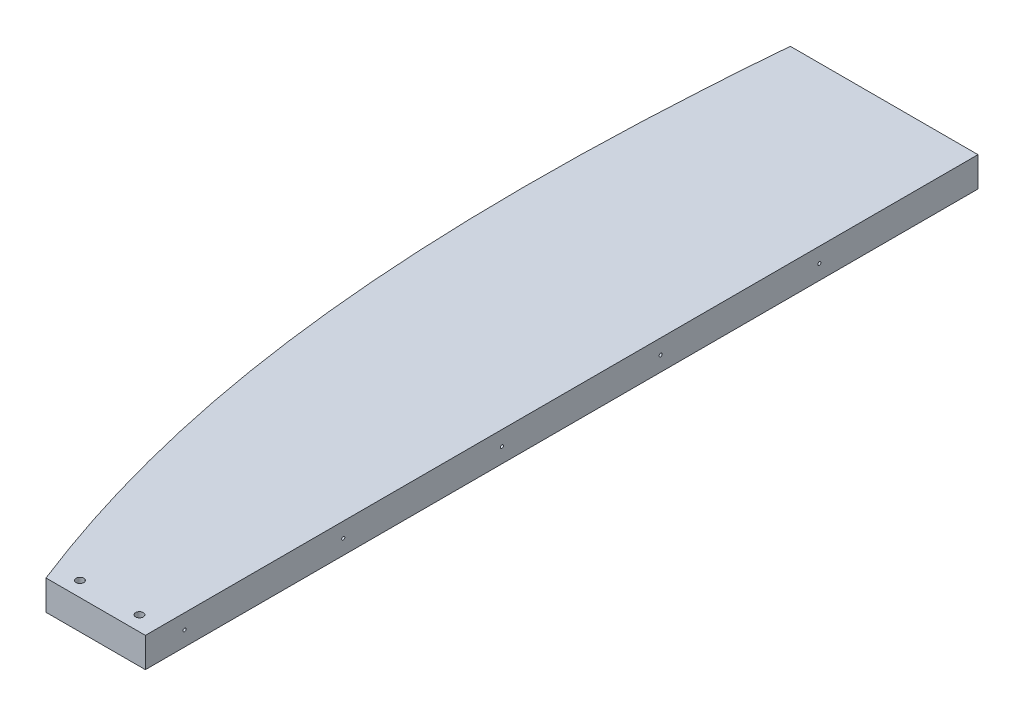
ISO-10303-21;
HEADER;
FILE_DESCRIPTION(('STEP AP214'),'2;1');
FILE_NAME('part.step','',(''),(''),'','','');
FILE_SCHEMA(('AUTOMOTIVE_DESIGN { 1 0 10303 214 1 1 1 1 }'));
ENDSEC;
DATA;
#1=APPLICATION_CONTEXT('core data for automotive mechanical design processes');
#2=APPLICATION_PROTOCOL_DEFINITION('international standard','automotive_design',2000,#1);
#3=PRODUCT_CONTEXT('',#1,'mechanical');
#4=PRODUCT('Part','Part','',(#3));
#5=PRODUCT_RELATED_PRODUCT_CATEGORY('part','',(#4));
#6=PRODUCT_DEFINITION_FORMATION('','',#4);
#7=PRODUCT_DEFINITION_CONTEXT('part definition',#1,'design');
#8=PRODUCT_DEFINITION('design','',#6,#7);
#9=PRODUCT_DEFINITION_SHAPE('','',#8);
#10=(LENGTH_UNIT() NAMED_UNIT(*) SI_UNIT(.MILLI.,.METRE.));
#11=(NAMED_UNIT(*) PLANE_ANGLE_UNIT() SI_UNIT($,.RADIAN.));
#12=(NAMED_UNIT(*) SI_UNIT($,.STERADIAN.) SOLID_ANGLE_UNIT());
#13=UNCERTAINTY_MEASURE_WITH_UNIT(LENGTH_MEASURE(1.E-05),#10,'distance_accuracy_value','');
#14=(GEOMETRIC_REPRESENTATION_CONTEXT(3) GLOBAL_UNCERTAINTY_ASSIGNED_CONTEXT((#13)) GLOBAL_UNIT_ASSIGNED_CONTEXT((#10,
#11,#12)) REPRESENTATION_CONTEXT('',''));
#15=CARTESIAN_POINT('',(0.,0.,0.));
#16=DIRECTION('',(0.,0.,1.));
#17=DIRECTION('',(1.,0.,0.));
#18=AXIS2_PLACEMENT_3D('',#15,#16,#17);
#19=CARTESIAN_POINT('',(-389.501606786899,5194.30000000001,2950.05622050594));
#20=DIRECTION('',(0.,1.,0.));
#21=DIRECTION('',(1.,0.,0.));
#22=AXIS2_PLACEMENT_3D('',#19,#20,#21);
#23=PLANE('',#22);
#24=CARTESIAN_POINT('',(-376.528681754764,5194.3,3207.07744091049));
#25=DIRECTION('',(0.,-1.,0.));
#26=DIRECTION('',(1.,0.,0.));
#27=AXIS2_PLACEMENT_3D('',#24,#25,#26);
#28=CIRCLE('',#27,2.45744999999997);
#29=CARTESIAN_POINT('',(-374.071231754764,5194.3,3207.07744091049));
#30=VERTEX_POINT('',#29);
#31=EDGE_CURVE('E239',#30,#30,#28,.T.);
#32=ORIENTED_EDGE('',*,*,#31,.F.);
#33=EDGE_LOOP('',(#32));
#34=FACE_BOUND('',#33,.T.);
#35=CARTESIAN_POINT('',(-338.428578956982,5194.3,3207.07744091058));
#36=DIRECTION('',(0.,-1.,0.));
#37=DIRECTION('',(1.,0.,0.));
#38=AXIS2_PLACEMENT_3D('',#35,#36,#37);
#39=CIRCLE('',#38,2.45744999999997);
#40=CARTESIAN_POINT('',(-335.971128956982,5194.3,3207.07744091058));
#41=VERTEX_POINT('',#40);
#42=EDGE_CURVE('E134',#41,#41,#39,.T.);
#43=ORIENTED_EDGE('',*,*,#42,.F.);
#44=EDGE_LOOP('',(#43));
#45=FACE_BOUND('',#44,.T.);
#46=DIRECTION('',(1.,0.,0.));
#47=VECTOR('',#46,1.);
#48=CARTESIAN_POINT('',(-445.271141729743,5194.3,2683.51));
#49=LINE('',#48,#47);
#50=CARTESIAN_POINT('',(-445.271141729743,5194.3,2683.51));
#51=VERTEX_POINT('',#50);
#52=CARTESIAN_POINT('',(-325.12,5194.30000000001,2683.51));
#53=VERTEX_POINT('',#52);
#54=EDGE_CURVE('E176',#51,#53,#49,.T.);
#55=ORIENTED_EDGE('',*,*,#54,.T.);
#56=DIRECTION('',(0.,0.,1.));
#57=VECTOR('',#56,1.);
#58=CARTESIAN_POINT('',(-325.12,5194.30000000001,2683.51));
#59=LINE('',#58,#57);
#60=CARTESIAN_POINT('',(-325.12,5194.30000000001,3216.60244101189));
#61=VERTEX_POINT('',#60);
#62=EDGE_CURVE('E192',#53,#61,#59,.T.);
#63=ORIENTED_EDGE('',*,*,#62,.T.);
#64=DIRECTION('',(-1.,0.,0.));
#65=VECTOR('',#64,1.);
#66=CARTESIAN_POINT('',(-325.12,5194.30000000001,3216.60244101189));
#67=LINE('',#66,#65);
#68=CARTESIAN_POINT('',(-388.748833209511,5194.3,3216.60244101189));
#69=VERTEX_POINT('',#68);
#70=EDGE_CURVE('E185',#61,#69,#67,.T.);
#71=ORIENTED_EDGE('',*,*,#70,.T.);
#72=CARTESIAN_POINT('',(-388.74883320951,5194.3,3216.60244101189));
#73=CARTESIAN_POINT('',(-389.522252968133,5194.30000000001,3214.63182176014));
#74=CARTESIAN_POINT('',(-390.288721724349,5194.30000000001,3212.65847358438));
#75=CARTESIAN_POINT('',(-391.807587176831,5194.30000000001,3208.70646110342));
#76=CARTESIAN_POINT('',(-392.559984442723,5194.30000000001,3206.72779701715));
#77=CARTESIAN_POINT('',(-394.050584006537,5194.30000000001,3202.7651760804));
#78=CARTESIAN_POINT('',(-394.788786601796,5194.30000000001,3200.78121934178));
#79=CARTESIAN_POINT('',(-396.25118247867,5194.30000000001,3196.8072370958));
#80=CARTESIAN_POINT('',(-396.975369962834,5194.30000000001,3194.81720945522));
#81=CARTESIAN_POINT('',(-398.409326379544,5194.30000000001,3190.8319153354));
#82=CARTESIAN_POINT('',(-399.11909500355,5194.30000000001,3188.83664874508));
#83=CARTESIAN_POINT('',(-400.524120705956,5194.30000000001,3184.84092335103));
#84=CARTESIAN_POINT('',(-401.219377144052,5194.3,3182.84046432257));
#85=CARTESIAN_POINT('',(-403.979981150922,5194.3,3174.80275179745));
#86=CARTESIAN_POINT('',(-405.98622936171,5194.30000000001,3168.7450562538));
#87=CARTESIAN_POINT('',(-409.864016063091,5194.30000000001,3156.58584521959));
#88=CARTESIAN_POINT('',(-411.735535675614,5194.30000000001,3150.48432371939));
#89=CARTESIAN_POINT('',(-415.342670234216,5194.30000000001,3138.24071743662));
#90=CARTESIAN_POINT('',(-417.078274865978,5194.30000000001,3132.09862961383));
#91=CARTESIAN_POINT('',(-420.413307310401,5194.30000000001,3119.77755039309));
#92=CARTESIAN_POINT('',(-422.01273391751,5194.30000000001,3113.59855866895));
#93=CARTESIAN_POINT('',(-425.076507654871,5194.30000000001,3101.20582036093));
#94=CARTESIAN_POINT('',(-426.540826480792,5194.30000000001,3094.99206678251));
#95=CARTESIAN_POINT('',(-429.335602965528,5194.30000000001,3082.53477442042));
#96=CARTESIAN_POINT('',(-430.666065285989,5194.30000000001,3076.29123668194));
#97=CARTESIAN_POINT('',(-433.195551254198,5194.30000000001,3063.77787947901));
#98=CARTESIAN_POINT('',(-434.394580050255,5194.30000000001,3057.50806105398));
#99=CARTESIAN_POINT('',(-436.664262798693,5194.30000000001,3044.94572418597));
#100=CARTESIAN_POINT('',(-437.734926596353,5194.3,3038.65320752207));
#101=CARTESIAN_POINT('',(-439.412841289309,5194.3,3028.16585891989));
#102=CARTESIAN_POINT('',(-440.054930598951,5194.30000000001,3023.97656044392));
#103=CARTESIAN_POINT('',(-441.285326649012,5194.30000000001,3015.59028760335));
#104=CARTESIAN_POINT('',(-441.87363620708,5194.30000000001,3011.39331365267));
#105=CARTESIAN_POINT('',(-442.997751229943,5194.30000000001,3002.99243079538));
#106=CARTESIAN_POINT('',(-443.533557687155,5194.30000000001,2998.7885220214));
#107=CARTESIAN_POINT('',(-444.553830346814,5194.30000000001,2990.37588429152));
#108=CARTESIAN_POINT('',(-445.038313336257,5194.30000000001,2986.16715736967));
#109=CARTESIAN_POINT('',(-445.95751189761,5194.30000000001,2977.74420167879));
#110=CARTESIAN_POINT('',(-446.392226612659,5194.30000000001,2973.5299728163));
#111=CARTESIAN_POINT('',(-447.213286250905,5194.30000000001,2965.0967391719));
#112=CARTESIAN_POINT('',(-447.59963020829,5194.3,2960.87773429634));
#113=CARTESIAN_POINT('',(-448.610399554394,5194.3,2949.12002029531));
#114=CARTESIAN_POINT('',(-449.183460079722,5194.30000000001,2941.57684955929));
#115=CARTESIAN_POINT('',(-450.188110587307,5194.30000000001,2926.48082596249));
#116=CARTESIAN_POINT('',(-450.61969436184,5194.30000000001,2918.92797269146));
#117=CARTESIAN_POINT('',(-451.167099565232,5194.30000000001,2907.5939338846));
#118=CARTESIAN_POINT('',(-451.332907313244,5194.30000000001,2903.81509221511));
#119=CARTESIAN_POINT('',(-451.632200630418,5194.30000000001,2896.2561191346));
#120=CARTESIAN_POINT('',(-451.765686187027,5194.30000000001,2892.47598772308));
#121=CARTESIAN_POINT('',(-452.001447257514,5194.30000000001,2884.91259385326));
#122=CARTESIAN_POINT('',(-452.10370488907,5194.30000000001,2881.12933084029));
#123=CARTESIAN_POINT('',(-452.277368935584,5194.30000000001,2873.56209999784));
#124=CARTESIAN_POINT('',(-452.348775360838,5194.30000000001,2869.77813216859));
#125=CARTESIAN_POINT('',(-452.462007398325,5194.30000000001,2862.20982426264));
#126=CARTESIAN_POINT('',(-452.503833548245,5194.30000000001,2858.42548419396));
#127=CARTESIAN_POINT('',(-452.558952189984,5194.30000000001,2850.85660436911));
#128=CARTESIAN_POINT('',(-452.572244665882,5194.30000000001,2847.07206461283));
#129=CARTESIAN_POINT('',(-452.570825815496,5194.30000000001,2835.71848246225));
#130=CARTESIAN_POINT('',(-452.514819254079,5194.3,2828.14940488104));
#131=CARTESIAN_POINT('',(-452.325706518356,5194.3,2814.8576360439));
#132=CARTESIAN_POINT('',(-452.214721414389,5194.30000000001,2809.13460593405));
#133=CARTESIAN_POINT('',(-451.936070151196,5194.30000000001,2797.68993762865));
#134=CARTESIAN_POINT('',(-451.768404183396,5194.30000000001,2791.96829942846));
#135=CARTESIAN_POINT('',(-451.378470854025,5194.30000000001,2780.52685123598));
#136=CARTESIAN_POINT('',(-451.156203086374,5194.30000000001,2774.80704125759));
#137=CARTESIAN_POINT('',(-450.658785505361,5194.30000000001,2763.36967450208));
#138=CARTESIAN_POINT('',(-450.3836352264,5194.30000000001,2757.65211774522));
#139=CARTESIAN_POINT('',(-449.782227506014,5194.30000000001,2746.22711571753));
#140=CARTESIAN_POINT('',(-449.456036663211,5194.30000000001,2740.51966693659));
#141=CARTESIAN_POINT('',(-448.75333687339,5194.30000000001,2729.10791697049));
#142=CARTESIAN_POINT('',(-448.376828318642,5194.30000000001,2723.40361576115));
#143=CARTESIAN_POINT('',(-447.574201897389,5194.30000000001,2711.99864715379));
#144=CARTESIAN_POINT('',(-447.148085321015,5194.30000000001,2706.29797966515));
#145=CARTESIAN_POINT('',(-446.471952170237,5194.30000000001,2697.75005038914));
#146=CARTESIAN_POINT('',(-446.240420243813,5194.30000000001,2694.9013153148));
#147=CARTESIAN_POINT('',(-445.765028486666,5194.30000000001,2689.20487423171));
#148=CARTESIAN_POINT('',(-445.521168656988,5194.30000000001,2686.35716822288));
#149=CARTESIAN_POINT('',(-445.271141729742,5194.3,2683.51));
#150=B_SPLINE_CURVE_WITH_KNOTS('',3,(#72,#73,#74,#75,#76,#77,#78,#79,#80,#81,#82,#83,#84,#85,
#86,#87,#88,#89,#90,#91,#92,#93,#94,#95,#96,#97,#98,#99,#100,#101,#102,#103,#104,#105,#106,#107,
#108,#109,#110,#111,#112,#113,#114,#115,#116,#117,#118,#119,#120,#121,#122,#123,#124,#125,#126,
#127,#128,#129,#130,#131,#132,#133,#134,#135,#136,#137,#138,#139,#140,#141,#142,#143,#144,#145,
#146,#147,#148,#149),.UNSPECIFIED.,.F.,.F.,(4,2,2,2,2,2,2,2,2,2,2,2,2,2,2,2,2,2,2,2,2,2,2,2,2,2,
2,2,2,2,2,2,2,2,2,2,2,2,4),(0.,6.35086701356958,12.7014763794555,19.051952573682,
25.4050018387976,31.7581869055687,38.1116516963094,57.2537350240519,76.3984953265147,
95.5447070815515,114.691088315576,133.841471545987,152.991187620061,172.140153323164,
191.287649407017,204.001986076296,216.715656228674,229.42908601974,242.13834455025,
254.847821863678,267.55755290496,290.250765480575,312.944973656978,324.292291318835,
335.639613387368,346.993421240414,358.347225304224,369.700822982525,381.054426996128,
403.761418106075,420.933479573431,438.105483047311,455.277614235264,472.449896620545,
489.599956338763,506.749882365399,523.899362482218,532.473724957064,541.048086704671),.UNSPECIFIED.);
#151=EDGE_CURVE('E183',#69,#51,#150,.T.);
#152=ORIENTED_EDGE('',*,*,#151,.T.);
#153=EDGE_LOOP('',(#55,#63,#71,#152));
#154=FACE_BOUND('',#153,.T.);
#155=ADVANCED_FACE('F50',(#34,#45,#154),#23,.F.);
#156=CARTESIAN_POINT('',(-325.12,5194.30000000001,2683.51));
#157=DIRECTION('',(1.,0.,0.));
#158=DIRECTION('',(0.,-1.,0.));
#159=AXIS2_PLACEMENT_3D('',#156,#157,#158);
#160=PLANE('',#159);
#161=CARTESIAN_POINT('',(-325.119999999999,5203.82500000001,2785.11));
#162=DIRECTION('',(-1.,0.,0.));
#163=DIRECTION('',(0.,-1.,0.));
#164=AXIS2_PLACEMENT_3D('',#161,#162,#163);
#165=CIRCLE('',#164,0.991870000000006);
#166=CARTESIAN_POINT('',(-325.119999999999,5202.83313000001,2785.11));
#167=VERTEX_POINT('',#166);
#168=EDGE_CURVE('E57',#167,#167,#165,.T.);
#169=ORIENTED_EDGE('',*,*,#168,.T.);
#170=EDGE_LOOP('',(#169));
#171=FACE_BOUND('',#170,.T.);
#172=CARTESIAN_POINT('',(-325.119999999999,5203.825,2886.71));
#173=DIRECTION('',(-1.,0.,0.));
#174=DIRECTION('',(0.,-1.,0.));
#175=AXIS2_PLACEMENT_3D('',#172,#173,#174);
#176=CIRCLE('',#175,0.991870000000006);
#177=CARTESIAN_POINT('',(-325.119999999999,5202.83313,2886.71));
#178=VERTEX_POINT('',#177);
#179=EDGE_CURVE('E145',#178,#178,#176,.T.);
#180=ORIENTED_EDGE('',*,*,#179,.T.);
#181=EDGE_LOOP('',(#180));
#182=FACE_BOUND('',#181,.T.);
#183=CARTESIAN_POINT('',(-325.119999999999,5203.825,2988.31));
#184=DIRECTION('',(-1.,0.,0.));
#185=DIRECTION('',(0.,-1.,0.));
#186=AXIS2_PLACEMENT_3D('',#183,#184,#185);
#187=CIRCLE('',#186,0.991870000000006);
#188=CARTESIAN_POINT('',(-325.119999999999,5202.83313,2988.31));
#189=VERTEX_POINT('',#188);
#190=EDGE_CURVE('E149',#189,#189,#187,.T.);
#191=ORIENTED_EDGE('',*,*,#190,.T.);
#192=EDGE_LOOP('',(#191));
#193=FACE_BOUND('',#192,.T.);
#194=CARTESIAN_POINT('',(-325.119999999999,5203.82500000001,3089.91));
#195=DIRECTION('',(-1.,0.,0.));
#196=DIRECTION('',(0.,-1.,0.));
#197=AXIS2_PLACEMENT_3D('',#194,#195,#196);
#198=CIRCLE('',#197,0.991870000000006);
#199=CARTESIAN_POINT('',(-325.119999999999,5202.83313000001,3089.91));
#200=VERTEX_POINT('',#199);
#201=EDGE_CURVE('E153',#200,#200,#198,.T.);
#202=ORIENTED_EDGE('',*,*,#201,.T.);
#203=EDGE_LOOP('',(#202));
#204=FACE_BOUND('',#203,.T.);
#205=CARTESIAN_POINT('',(-325.119999999999,5203.825,3191.51));
#206=DIRECTION('',(-1.,0.,0.));
#207=DIRECTION('',(0.,-1.,0.));
#208=AXIS2_PLACEMENT_3D('',#205,#206,#207);
#209=CIRCLE('',#208,0.991870000000006);
#210=CARTESIAN_POINT('',(-325.119999999999,5202.83313,3191.51));
#211=VERTEX_POINT('',#210);
#212=EDGE_CURVE('E157',#211,#211,#209,.T.);
#213=ORIENTED_EDGE('',*,*,#212,.T.);
#214=EDGE_LOOP('',(#213));
#215=FACE_BOUND('',#214,.T.);
#216=DIRECTION('',(0.,0.,1.));
#217=VECTOR('',#216,1.);
#218=CARTESIAN_POINT('',(-325.12,5213.35,2950.05622050594));
#219=LINE('',#218,#217);
#220=CARTESIAN_POINT('',(-325.119999999999,5213.35,2683.51));
#221=VERTEX_POINT('',#220);
#222=CARTESIAN_POINT('',(-325.119999999999,5213.35,3216.60244101189));
#223=VERTEX_POINT('',#222);
#224=EDGE_CURVE('E170',#221,#223,#219,.T.);
#225=ORIENTED_EDGE('',*,*,#224,.T.);
#226=DIRECTION('',(0.,1.,0.));
#227=VECTOR('',#226,1.);
#228=CARTESIAN_POINT('',(-325.12,5194.30000000001,3216.60244101189));
#229=LINE('',#228,#227);
#230=EDGE_CURVE('E93',#223,#61,#229,.F.);
#231=ORIENTED_EDGE('',*,*,#230,.T.);
#232=ORIENTED_EDGE('',*,*,#62,.F.);
#233=DIRECTION('',(0.,1.,0.));
#234=VECTOR('',#233,1.);
#235=CARTESIAN_POINT('',(-325.12,5194.30000000001,2683.51));
#236=LINE('',#235,#234);
#237=EDGE_CURVE('E104',#53,#221,#236,.T.);
#238=ORIENTED_EDGE('',*,*,#237,.T.);
#239=EDGE_LOOP('',(#225,#231,#232,#238));
#240=FACE_BOUND('',#239,.T.);
#241=ADVANCED_FACE('F228',(#171,#182,#193,#204,#215,#240),#160,.T.);
#242=CARTESIAN_POINT('',(-325.12,5194.30000000001,3216.60244101189));
#243=DIRECTION('',(0.,0.,1.));
#244=DIRECTION('',(-1.,0.,0.));
#245=AXIS2_PLACEMENT_3D('',#242,#243,#244);
#246=PLANE('',#245);
#247=DIRECTION('',(1.,0.,0.));
#248=VECTOR('',#247,1.);
#249=CARTESIAN_POINT('',(-389.5016067869,5213.35000000001,3216.60244101189));
#250=LINE('',#249,#248);
#251=CARTESIAN_POINT('',(-388.748833209508,5213.35000000001,3216.60244101189));
#252=VERTEX_POINT('',#251);
#253=EDGE_CURVE('E168',#223,#252,#250,.F.);
#254=ORIENTED_EDGE('',*,*,#253,.T.);
#255=DIRECTION('',(-1.36946010087513E-13,-1.,0.));
#256=VECTOR('',#255,1.);
#257=CARTESIAN_POINT('',(-388.74883320951,5203.82500000001,3216.60244101189));
#258=LINE('',#257,#256);
#259=EDGE_CURVE('E82',#252,#69,#258,.T.);
#260=ORIENTED_EDGE('',*,*,#259,.T.);
#261=ORIENTED_EDGE('',*,*,#70,.F.);
#262=ORIENTED_EDGE('',*,*,#230,.F.);
#263=EDGE_LOOP('',(#254,#260,#261,#262));
#264=FACE_BOUND('',#263,.T.);
#265=ADVANCED_FACE('F225',(#264),#246,.T.);
#266=CARTESIAN_POINT('',(-388.74883320951,5194.3,3216.60244101189));
#267=CARTESIAN_POINT('',(-388.748833209508,5213.35000000001,3216.60244101189));
#268=CARTESIAN_POINT('',(-427.328274562889,5194.30000000001,3118.30445867765));
#269=CARTESIAN_POINT('',(-427.328274562889,5213.35000000001,3118.30445867765));
#270=CARTESIAN_POINT('',(-448.538626648828,5194.3,3013.430965814));
#271=CARTESIAN_POINT('',(-448.538626648824,5213.35000000001,3013.430965814));
#272=CARTESIAN_POINT('',(-453.875260666028,5194.30000000001,2815.15896694759));
#273=CARTESIAN_POINT('',(-453.875260666026,5213.35000000001,2815.15896694759));
#274=CARTESIAN_POINT('',(-450.721614948779,5194.3,2745.57602142326));
#275=CARTESIAN_POINT('',(-450.721614948777,5213.35,2745.57602142326));
#276=CARTESIAN_POINT('',(-445.271141729743,5194.3,2683.51));
#277=CARTESIAN_POINT('',(-445.271141729743,5213.35,2683.51));
#278=B_SPLINE_SURFACE_WITH_KNOTS('',3,1,((#266,#267),(#268,#269),(#270,#271),(#272,#273),(#274,
#275),(#276,#277)),.UNSPECIFIED.,.F.,.F.,.F.,(4,2,4),(2,2),(-53.1349686655124,-24.0856941468216,
-9.03456928373366),(0.,1.90499999999997),.UNSPECIFIED.);
#279=CARTESIAN_POINT('',(-388.748833209508,5213.35000000001,3216.60244101189));
#280=CARTESIAN_POINT('',(-389.522252968131,5213.35000000001,3214.63182176014));
#281=CARTESIAN_POINT('',(-390.288721724347,5213.35000000001,3212.65847358438));
#282=CARTESIAN_POINT('',(-391.807587176829,5213.35000000001,3208.70646110342));
#283=CARTESIAN_POINT('',(-392.559984442721,5213.35000000001,3206.72779701715));
#284=CARTESIAN_POINT('',(-394.050584006536,5213.35000000001,3202.7651760804));
#285=CARTESIAN_POINT('',(-394.788786601795,5213.35000000001,3200.78121934178));
#286=CARTESIAN_POINT('',(-396.251182478668,5213.35000000001,3196.80723709581));
#287=CARTESIAN_POINT('',(-396.975369962833,5213.35000000001,3194.81720945522));
#288=CARTESIAN_POINT('',(-398.409326379543,5213.35000000001,3190.8319153354));
#289=CARTESIAN_POINT('',(-399.119095003549,5213.35000000001,3188.83664874508));
#290=CARTESIAN_POINT('',(-400.524120705955,5213.35000000001,3184.84092335103));
#291=CARTESIAN_POINT('',(-401.219377144051,5213.35,3182.84046432257));
#292=CARTESIAN_POINT('',(-403.979981150921,5213.35,3174.80275179745));
#293=CARTESIAN_POINT('',(-405.986229361709,5213.35000000001,3168.7450562538));
#294=CARTESIAN_POINT('',(-409.86401606309,5213.35000000001,3156.58584521959));
#295=CARTESIAN_POINT('',(-411.735535675613,5213.35000000001,3150.48432371939));
#296=CARTESIAN_POINT('',(-415.342670234215,5213.35000000001,3138.24071743662));
#297=CARTESIAN_POINT('',(-417.078274865977,5213.35000000001,3132.09862961383));
#298=CARTESIAN_POINT('',(-420.413307310399,5213.35000000001,3119.77755039309));
#299=CARTESIAN_POINT('',(-422.012733917509,5213.35000000001,3113.59855866895));
#300=CARTESIAN_POINT('',(-425.07650765487,5213.35000000001,3101.20582036093));
#301=CARTESIAN_POINT('',(-426.540826480791,5213.35000000001,3094.99206678251));
#302=CARTESIAN_POINT('',(-429.335602965527,5213.35000000001,3082.53477442042));
#303=CARTESIAN_POINT('',(-430.666065285987,5213.35000000001,3076.29123668194));
#304=CARTESIAN_POINT('',(-433.195551254196,5213.35000000001,3063.77787947901));
#305=CARTESIAN_POINT('',(-434.394580050253,5213.35000000001,3057.50806105398));
#306=CARTESIAN_POINT('',(-436.664262798691,5213.35000000001,3044.94572418597));
#307=CARTESIAN_POINT('',(-437.734926596351,5213.35,3038.65320752207));
#308=CARTESIAN_POINT('',(-439.412841289307,5213.35,3028.16585891989));
#309=CARTESIAN_POINT('',(-440.054930598949,5213.35000000001,3023.97656044392));
#310=CARTESIAN_POINT('',(-441.285326649009,5213.35000000001,3015.59028760335));
#311=CARTESIAN_POINT('',(-441.873636207078,5213.35000000001,3011.39331365267));
#312=CARTESIAN_POINT('',(-442.99775122994,5213.35000000001,3002.99243079538));
#313=CARTESIAN_POINT('',(-443.533557687153,5213.35000000001,2998.7885220214));
#314=CARTESIAN_POINT('',(-444.553830346812,5213.35000000001,2990.37588429152));
#315=CARTESIAN_POINT('',(-445.038313336254,5213.35000000001,2986.16715736967));
#316=CARTESIAN_POINT('',(-445.957511897607,5213.35000000001,2977.74420167879));
#317=CARTESIAN_POINT('',(-446.392226612657,5213.35000000001,2973.5299728163));
#318=CARTESIAN_POINT('',(-447.213286250903,5213.35000000001,2965.0967391719));
#319=CARTESIAN_POINT('',(-447.599630208288,5213.35,2960.87773429634));
#320=CARTESIAN_POINT('',(-448.610399554391,5213.35,2949.12002029531));
#321=CARTESIAN_POINT('',(-449.183460079719,5213.35000000001,2941.57684955929));
#322=CARTESIAN_POINT('',(-450.188110587304,5213.35000000001,2926.48082596249));
#323=CARTESIAN_POINT('',(-450.619694361837,5213.35000000001,2918.92797269146));
#324=CARTESIAN_POINT('',(-451.167099565229,5213.35000000001,2907.5939338846));
#325=CARTESIAN_POINT('',(-451.332907313241,5213.35000000001,2903.81509221511));
#326=CARTESIAN_POINT('',(-451.632200630415,5213.35000000001,2896.2561191346));
#327=CARTESIAN_POINT('',(-451.765686187025,5213.35000000001,2892.47598772308));
#328=CARTESIAN_POINT('',(-452.001447257511,5213.35000000001,2884.91259385326));
#329=CARTESIAN_POINT('',(-452.103704889068,5213.35000000001,2881.12933084029));
#330=CARTESIAN_POINT('',(-452.277368935581,5213.35000000001,2873.56209999784));
#331=CARTESIAN_POINT('',(-452.348775360835,5213.35000000001,2869.77813216859));
#332=CARTESIAN_POINT('',(-452.462007398322,5213.35000000001,2862.20982426264));
#333=CARTESIAN_POINT('',(-452.503833548242,5213.35000000001,2858.42548419396));
#334=CARTESIAN_POINT('',(-452.558952189981,5213.35000000001,2850.8566043691));
#335=CARTESIAN_POINT('',(-452.572244665879,5213.35000000001,2847.07206461283));
#336=CARTESIAN_POINT('',(-452.570825815494,5213.35000000001,2835.71848246225));
#337=CARTESIAN_POINT('',(-452.514819254077,5213.35,2828.14940488104));
#338=CARTESIAN_POINT('',(-452.325706518354,5213.35,2814.8576360439));
#339=CARTESIAN_POINT('',(-452.214721414387,5213.35000000001,2809.13460593405));
#340=CARTESIAN_POINT('',(-451.936070151194,5213.35000000001,2797.68993762865));
#341=CARTESIAN_POINT('',(-451.768404183394,5213.35000000001,2791.96829942846));
#342=CARTESIAN_POINT('',(-451.378470854023,5213.35000000001,2780.52685123598));
#343=CARTESIAN_POINT('',(-451.156203086372,5213.35000000001,2774.80704125759));
#344=CARTESIAN_POINT('',(-450.65878550536,5213.35000000001,2763.36967450208));
#345=CARTESIAN_POINT('',(-450.383635226399,5213.35000000001,2757.65211774522));
#346=CARTESIAN_POINT('',(-449.782227506013,5213.35000000001,2746.22711571754));
#347=CARTESIAN_POINT('',(-449.456036663209,5213.35000000001,2740.51966693659));
#348=CARTESIAN_POINT('',(-448.753336873388,5213.35000000001,2729.10791697049));
#349=CARTESIAN_POINT('',(-448.37682831864,5213.35000000001,2723.40361576115));
#350=CARTESIAN_POINT('',(-447.574201897388,5213.35000000001,2711.99864715379));
#351=CARTESIAN_POINT('',(-447.148085321015,5213.35000000001,2706.29797966515));
#352=CARTESIAN_POINT('',(-446.471952170236,5213.35000000001,2697.75005038914));
#353=CARTESIAN_POINT('',(-446.240420243812,5213.35000000001,2694.9013153148));
#354=CARTESIAN_POINT('',(-445.765028486665,5213.35000000001,2689.20487423171));
#355=CARTESIAN_POINT('',(-445.521168656988,5213.35000000001,2686.35716822288));
#356=CARTESIAN_POINT('',(-445.271141729743,5213.35,2683.51));
#357=B_SPLINE_CURVE_WITH_KNOTS('',3,(#279,#280,#281,#282,#283,#284,#285,#286,#287,#288,#289,
#290,#291,#292,#293,#294,#295,#296,#297,#298,#299,#300,#301,#302,#303,#304,#305,#306,#307,#308,
#309,#310,#311,#312,#313,#314,#315,#316,#317,#318,#319,#320,#321,#322,#323,#324,#325,#326,#327,
#328,#329,#330,#331,#332,#333,#334,#335,#336,#337,#338,#339,#340,#341,#342,#343,#344,#345,#346,
#347,#348,#349,#350,#351,#352,#353,#354,#355,#356),.UNSPECIFIED.,.F.,.F.,(4,2,2,2,2,2,2,2,2,2,2,
2,2,2,2,2,2,2,2,2,2,2,2,2,2,2,2,2,2,2,2,2,2,2,2,2,2,2,4),(0.,6.35086701356911,12.7014763794547,
19.0519525736817,25.4050018387973,31.7581869055684,38.1116516963087,57.2537350240516,
76.3984953265145,95.5447070815512,114.691088315576,133.841471545987,152.99118762006,
172.140153323165,191.287649407017,204.001986076296,216.715656228675,229.42908601974,
242.13834455025,254.847821863678,267.55755290496,290.250765480575,312.944973656978,
324.292291318835,335.639613387368,346.993421240414,358.347225304224,369.700822982526,
381.054426996129,403.761418106075,420.933479573431,438.10548304731,455.277614235263,
472.449896620544,489.599956338762,506.749882365398,523.899362482217,532.473724957062,
541.04808670467),.UNSPECIFIED.);
#358=CARTESIAN_POINT('',(-445.271141729743,5213.35000000001,2683.51));
#359=VERTEX_POINT('',#358);
#360=EDGE_CURVE('E63',#252,#359,#357,.T.);
#361=DIRECTION('',(0.,1.,0.));
#362=VECTOR('',#361,1.);
#363=CARTESIAN_POINT('',(-445.271141729743,5194.3,2683.51));
#364=LINE('',#363,#362);
#365=EDGE_CURVE('E173',#359,#51,#364,.F.);
#366=ORIENTED_EDGE('',*,*,#360,.T.);
#367=ORIENTED_EDGE('',*,*,#365,.T.);
#368=ORIENTED_EDGE('',*,*,#151,.F.);
#369=ORIENTED_EDGE('',*,*,#259,.F.);
#370=EDGE_LOOP('',(#366,#367,#368,#369));
#371=FACE_BOUND('',#370,.T.);
#372=ADVANCED_FACE('F52',(#371),#278,.F.);
#373=CARTESIAN_POINT('',(-445.271141729743,5194.3,2683.51));
#374=DIRECTION('',(0.,0.,-1.));
#375=DIRECTION('',(1.,0.,0.));
#376=AXIS2_PLACEMENT_3D('',#373,#374,#375);
#377=PLANE('',#376);
#378=CARTESIAN_POINT('',(-414.990074060501,5203.825,2683.51));
#379=DIRECTION('',(0.,0.,1.));
#380=DIRECTION('',(1.,0.,0.));
#381=AXIS2_PLACEMENT_3D('',#378,#379,#380);
#382=CIRCLE('',#381,0.991870000000006);
#383=CARTESIAN_POINT('',(-413.998204060501,5203.825,2683.51));
#384=VERTEX_POINT('',#383);
#385=EDGE_CURVE('E161',#384,#384,#382,.T.);
#386=ORIENTED_EDGE('',*,*,#385,.T.);
#387=EDGE_LOOP('',(#386));
#388=FACE_BOUND('',#387,.T.);
#389=CARTESIAN_POINT('',(-355.076691353501,5203.825,2683.51));
#390=DIRECTION('',(0.,0.,1.));
#391=DIRECTION('',(1.,0.,0.));
#392=AXIS2_PLACEMENT_3D('',#389,#390,#391);
#393=CIRCLE('',#392,0.991870000000006);
#394=CARTESIAN_POINT('',(-354.084821353501,5203.825,2683.51));
#395=VERTEX_POINT('',#394);
#396=EDGE_CURVE('E164',#395,#395,#393,.T.);
#397=ORIENTED_EDGE('',*,*,#396,.T.);
#398=EDGE_LOOP('',(#397));
#399=FACE_BOUND('',#398,.T.);
#400=DIRECTION('',(1.,0.,0.));
#401=VECTOR('',#400,1.);
#402=CARTESIAN_POINT('',(-389.5016067869,5213.35,2683.51));
#403=LINE('',#402,#401);
#404=EDGE_CURVE('E13',#359,#221,#403,.T.);
#405=ORIENTED_EDGE('',*,*,#404,.T.);
#406=ORIENTED_EDGE('',*,*,#237,.F.);
#407=ORIENTED_EDGE('',*,*,#54,.F.);
#408=ORIENTED_EDGE('',*,*,#365,.F.);
#409=EDGE_LOOP('',(#405,#406,#407,#408));
#410=FACE_BOUND('',#409,.T.);
#411=ADVANCED_FACE('F219',(#388,#399,#410),#377,.T.);
#412=CARTESIAN_POINT('',(-389.5016067869,5213.35,2950.05622050594));
#413=DIRECTION('',(0.,1.,0.));
#414=DIRECTION('',(1.,0.,0.));
#415=AXIS2_PLACEMENT_3D('',#412,#413,#414);
#416=PLANE('',#415);
#417=CARTESIAN_POINT('',(-376.528681754765,5213.35,3207.07744091049));
#418=DIRECTION('',(0.,-1.,0.));
#419=DIRECTION('',(0.,0.,1.));
#420=AXIS2_PLACEMENT_3D('',#417,#418,#419);
#421=CIRCLE('',#420,2.45744999999997);
#422=CARTESIAN_POINT('',(-376.528681754765,5213.35,3209.53489091049));
#423=VERTEX_POINT('',#422);
#424=EDGE_CURVE('E433',#423,#423,#421,.T.);
#425=ORIENTED_EDGE('',*,*,#424,.T.);
#426=EDGE_LOOP('',(#425));
#427=FACE_BOUND('',#426,.T.);
#428=CARTESIAN_POINT('',(-338.428578956982,5213.35,3207.07744091058));
#429=DIRECTION('',(0.,-1.,0.));
#430=DIRECTION('',(0.,0.,1.));
#431=AXIS2_PLACEMENT_3D('',#428,#429,#430);
#432=CIRCLE('',#431,2.45744999999997);
#433=CARTESIAN_POINT('',(-338.428578956982,5213.35,3209.53489091058));
#434=VERTEX_POINT('',#433);
#435=EDGE_CURVE('E139',#434,#434,#432,.T.);
#436=ORIENTED_EDGE('',*,*,#435,.T.);
#437=EDGE_LOOP('',(#436));
#438=FACE_BOUND('',#437,.T.);
#439=ORIENTED_EDGE('',*,*,#360,.F.);
#440=ORIENTED_EDGE('',*,*,#253,.F.);
#441=ORIENTED_EDGE('',*,*,#224,.F.);
#442=ORIENTED_EDGE('',*,*,#404,.F.);
#443=EDGE_LOOP('',(#439,#440,#441,#442));
#444=FACE_BOUND('',#443,.T.);
#445=ADVANCED_FACE('F213',(#427,#438,#444),#416,.T.);
#446=CARTESIAN_POINT('',(-355.076691353501,5203.825,2702.56));
#447=DIRECTION('',(0.,0.,-1.));
#448=DIRECTION('',(1.,0.,0.));
#449=AXIS2_PLACEMENT_3D('',#446,#447,#448);
#450=CONICAL_SURFACE('',#449,0.991870000000006,1.02974425867677);
#451=CARTESIAN_POINT('',(-355.076691353501,5203.825,2703.1559756222));
#452=VERTEX_POINT('',#451);
#453=VERTEX_LOOP('',#452);
#454=FACE_BOUND('',#453,.T.);
#455=CARTESIAN_POINT('',(-355.076691353501,5203.825,2702.56));
#456=DIRECTION('',(0.,0.,1.));
#457=DIRECTION('',(1.,0.,0.));
#458=AXIS2_PLACEMENT_3D('',#455,#456,#457);
#459=CIRCLE('',#458,0.991870000000006);
#460=CARTESIAN_POINT('',(-354.084821353501,5203.825,2702.56));
#461=VERTEX_POINT('',#460);
#462=EDGE_CURVE('E162',#461,#461,#459,.T.);
#463=ORIENTED_EDGE('',*,*,#462,.F.);
#464=EDGE_LOOP('',(#463));
#465=FACE_BOUND('',#464,.T.);
#466=ADVANCED_FACE('F218',(#454,#465),#450,.F.);
#467=CARTESIAN_POINT('',(-355.0766913535,5203.825,2664.46));
#468=DIRECTION('',(0.,0.,-1.));
#469=DIRECTION('',(1.,0.,0.));
#470=AXIS2_PLACEMENT_3D('',#467,#468,#469);
#471=CYLINDRICAL_SURFACE('',#470,0.991870000000006);
#472=ORIENTED_EDGE('',*,*,#396,.F.);
#473=EDGE_LOOP('',(#472));
#474=FACE_BOUND('',#473,.T.);
#475=ORIENTED_EDGE('',*,*,#462,.T.);
#476=EDGE_LOOP('',(#475));
#477=FACE_BOUND('',#476,.T.);
#478=ADVANCED_FACE('F263',(#474,#477),#471,.F.);
#479=CARTESIAN_POINT('',(-414.990074060502,5203.825,2702.56));
#480=DIRECTION('',(0.,0.,-1.));
#481=DIRECTION('',(1.,0.,0.));
#482=AXIS2_PLACEMENT_3D('',#479,#480,#481);
#483=CONICAL_SURFACE('',#482,0.991870000000006,1.02974425867677);
#484=CARTESIAN_POINT('',(-414.990074060502,5203.825,2703.1559756222));
#485=VERTEX_POINT('',#484);
#486=VERTEX_LOOP('',#485);
#487=FACE_BOUND('',#486,.T.);
#488=CARTESIAN_POINT('',(-414.990074060502,5203.825,2702.56));
#489=DIRECTION('',(0.,0.,1.));
#490=DIRECTION('',(1.,0.,0.));
#491=AXIS2_PLACEMENT_3D('',#488,#489,#490);
#492=CIRCLE('',#491,0.991870000000006);
#493=CARTESIAN_POINT('',(-413.998204060502,5203.825,2702.56));
#494=VERTEX_POINT('',#493);
#495=EDGE_CURVE('E158',#494,#494,#492,.T.);
#496=ORIENTED_EDGE('',*,*,#495,.F.);
#497=EDGE_LOOP('',(#496));
#498=FACE_BOUND('',#497,.T.);
#499=ADVANCED_FACE('F270',(#487,#498),#483,.F.);
#500=CARTESIAN_POINT('',(-414.990074060501,5203.825,2664.46));
#501=DIRECTION('',(0.,0.,-1.));
#502=DIRECTION('',(1.,0.,0.));
#503=AXIS2_PLACEMENT_3D('',#500,#501,#502);
#504=CYLINDRICAL_SURFACE('',#503,0.991870000000006);
#505=ORIENTED_EDGE('',*,*,#385,.F.);
#506=EDGE_LOOP('',(#505));
#507=FACE_BOUND('',#506,.T.);
#508=ORIENTED_EDGE('',*,*,#495,.T.);
#509=EDGE_LOOP('',(#508));
#510=FACE_BOUND('',#509,.T.);
#511=ADVANCED_FACE('F277',(#507,#510),#504,.F.);
#512=CARTESIAN_POINT('',(-344.17,5203.825,3191.51));
#513=DIRECTION('',(1.,0.,0.));
#514=DIRECTION('',(0.,0.,1.));
#515=AXIS2_PLACEMENT_3D('',#512,#513,#514);
#516=CONICAL_SURFACE('',#515,0.991870000000006,1.02974425867665);
#517=CARTESIAN_POINT('',(-344.765975622194,5203.825,3191.51));
#518=VERTEX_POINT('',#517);
#519=VERTEX_LOOP('',#518);
#520=FACE_BOUND('',#519,.T.);
#521=CARTESIAN_POINT('',(-344.17,5203.825,3191.51));
#522=DIRECTION('',(-1.,0.,0.));
#523=DIRECTION('',(0.,0.,1.));
#524=AXIS2_PLACEMENT_3D('',#521,#522,#523);
#525=CIRCLE('',#524,0.991870000000006);
#526=CARTESIAN_POINT('',(-344.17,5203.825,3192.50187));
#527=VERTEX_POINT('',#526);
#528=EDGE_CURVE('E154',#527,#527,#525,.T.);
#529=ORIENTED_EDGE('',*,*,#528,.F.);
#530=EDGE_LOOP('',(#529));
#531=FACE_BOUND('',#530,.T.);
#532=ADVANCED_FACE('F285',(#520,#531),#516,.F.);
#533=CARTESIAN_POINT('',(-312.42,5203.825,3191.51));
#534=DIRECTION('',(1.,0.,0.));
#535=DIRECTION('',(0.,0.,1.));
#536=AXIS2_PLACEMENT_3D('',#533,#534,#535);
#537=CYLINDRICAL_SURFACE('',#536,0.991870000000006);
#538=ORIENTED_EDGE('',*,*,#212,.F.);
#539=EDGE_LOOP('',(#538));
#540=FACE_BOUND('',#539,.T.);
#541=ORIENTED_EDGE('',*,*,#528,.T.);
#542=EDGE_LOOP('',(#541));
#543=FACE_BOUND('',#542,.T.);
#544=ADVANCED_FACE('F293',(#540,#543),#537,.F.);
#545=CARTESIAN_POINT('',(-344.17,5203.82500000001,3089.91));
#546=DIRECTION('',(1.,0.,0.));
#547=DIRECTION('',(0.,0.,1.));
#548=AXIS2_PLACEMENT_3D('',#545,#546,#547);
#549=CONICAL_SURFACE('',#548,0.991870000000006,1.02974425867665);
#550=CARTESIAN_POINT('',(-344.765975622194,5203.82500000001,3089.91));
#551=VERTEX_POINT('',#550);
#552=VERTEX_LOOP('',#551);
#553=FACE_BOUND('',#552,.T.);
#554=CARTESIAN_POINT('',(-344.17,5203.82500000001,3089.91));
#555=DIRECTION('',(-1.,0.,0.));
#556=DIRECTION('',(0.,0.,1.));
#557=AXIS2_PLACEMENT_3D('',#554,#555,#556);
#558=CIRCLE('',#557,0.991870000000006);
#559=CARTESIAN_POINT('',(-344.17,5203.82500000001,3090.90187));
#560=VERTEX_POINT('',#559);
#561=EDGE_CURVE('E150',#560,#560,#558,.T.);
#562=ORIENTED_EDGE('',*,*,#561,.F.);
#563=EDGE_LOOP('',(#562));
#564=FACE_BOUND('',#563,.T.);
#565=ADVANCED_FACE('F301',(#553,#564),#549,.F.);
#566=CARTESIAN_POINT('',(-312.419999999999,5203.825,3089.91));
#567=DIRECTION('',(1.,0.,0.));
#568=DIRECTION('',(0.,0.,1.));
#569=AXIS2_PLACEMENT_3D('',#566,#567,#568);
#570=CYLINDRICAL_SURFACE('',#569,0.991870000000006);
#571=ORIENTED_EDGE('',*,*,#201,.F.);
#572=EDGE_LOOP('',(#571));
#573=FACE_BOUND('',#572,.T.);
#574=ORIENTED_EDGE('',*,*,#561,.T.);
#575=EDGE_LOOP('',(#574));
#576=FACE_BOUND('',#575,.T.);
#577=ADVANCED_FACE('F309',(#573,#576),#570,.F.);
#578=CARTESIAN_POINT('',(-344.17,5203.825,2988.31));
#579=DIRECTION('',(1.,0.,0.));
#580=DIRECTION('',(0.,0.,1.));
#581=AXIS2_PLACEMENT_3D('',#578,#579,#580);
#582=CONICAL_SURFACE('',#581,0.991870000000006,1.02974425867665);
#583=CARTESIAN_POINT('',(-344.765975622195,5203.825,2988.31));
#584=VERTEX_POINT('',#583);
#585=VERTEX_LOOP('',#584);
#586=FACE_BOUND('',#585,.T.);
#587=CARTESIAN_POINT('',(-344.17,5203.825,2988.31));
#588=DIRECTION('',(-1.,0.,0.));
#589=DIRECTION('',(0.,0.,1.));
#590=AXIS2_PLACEMENT_3D('',#587,#588,#589);
#591=CIRCLE('',#590,0.991870000000006);
#592=CARTESIAN_POINT('',(-344.17,5203.825,2989.30187));
#593=VERTEX_POINT('',#592);
#594=EDGE_CURVE('E146',#593,#593,#591,.T.);
#595=ORIENTED_EDGE('',*,*,#594,.F.);
#596=EDGE_LOOP('',(#595));
#597=FACE_BOUND('',#596,.T.);
#598=ADVANCED_FACE('F317',(#586,#597),#582,.F.);
#599=CARTESIAN_POINT('',(-312.42,5203.825,2988.31));
#600=DIRECTION('',(1.,0.,0.));
#601=DIRECTION('',(0.,0.,1.));
#602=AXIS2_PLACEMENT_3D('',#599,#600,#601);
#603=CYLINDRICAL_SURFACE('',#602,0.991870000000006);
#604=ORIENTED_EDGE('',*,*,#190,.F.);
#605=EDGE_LOOP('',(#604));
#606=FACE_BOUND('',#605,.T.);
#607=ORIENTED_EDGE('',*,*,#594,.T.);
#608=EDGE_LOOP('',(#607));
#609=FACE_BOUND('',#608,.T.);
#610=ADVANCED_FACE('F325',(#606,#609),#603,.F.);
#611=CARTESIAN_POINT('',(-344.17,5203.825,2886.71));
#612=DIRECTION('',(1.,0.,0.));
#613=DIRECTION('',(0.,0.,1.));
#614=AXIS2_PLACEMENT_3D('',#611,#612,#613);
#615=CONICAL_SURFACE('',#614,0.991870000000006,1.02974425867665);
#616=CARTESIAN_POINT('',(-344.765975622194,5203.825,2886.71));
#617=VERTEX_POINT('',#616);
#618=VERTEX_LOOP('',#617);
#619=FACE_BOUND('',#618,.T.);
#620=CARTESIAN_POINT('',(-344.17,5203.825,2886.71));
#621=DIRECTION('',(-1.,0.,0.));
#622=DIRECTION('',(0.,0.,1.));
#623=AXIS2_PLACEMENT_3D('',#620,#621,#622);
#624=CIRCLE('',#623,0.991870000000006);
#625=CARTESIAN_POINT('',(-344.17,5203.825,2887.70187));
#626=VERTEX_POINT('',#625);
#627=EDGE_CURVE('E137',#626,#626,#624,.T.);
#628=ORIENTED_EDGE('',*,*,#627,.F.);
#629=EDGE_LOOP('',(#628));
#630=FACE_BOUND('',#629,.T.);
#631=ADVANCED_FACE('F333',(#619,#630),#615,.F.);
#632=CARTESIAN_POINT('',(-312.42,5203.825,2886.71));
#633=DIRECTION('',(1.,0.,0.));
#634=DIRECTION('',(0.,0.,1.));
#635=AXIS2_PLACEMENT_3D('',#632,#633,#634);
#636=CYLINDRICAL_SURFACE('',#635,0.991870000000006);
#637=ORIENTED_EDGE('',*,*,#179,.F.);
#638=EDGE_LOOP('',(#637));
#639=FACE_BOUND('',#638,.T.);
#640=ORIENTED_EDGE('',*,*,#627,.T.);
#641=EDGE_LOOP('',(#640));
#642=FACE_BOUND('',#641,.T.);
#643=ADVANCED_FACE('F128',(#639,#642),#636,.F.);
#644=CARTESIAN_POINT('',(-344.169999999999,5203.825,2785.11));
#645=DIRECTION('',(1.,0.,0.));
#646=DIRECTION('',(0.,0.,1.));
#647=AXIS2_PLACEMENT_3D('',#644,#645,#646);
#648=CONICAL_SURFACE('',#647,0.991870000000006,1.02974425867665);
#649=CARTESIAN_POINT('',(-344.765975622194,5203.82500000001,2785.11));
#650=VERTEX_POINT('',#649);
#651=VERTEX_LOOP('',#650);
#652=FACE_BOUND('',#651,.T.);
#653=CARTESIAN_POINT('',(-344.169999999999,5203.825,2785.11));
#654=DIRECTION('',(-1.,0.,0.));
#655=DIRECTION('',(0.,0.,1.));
#656=AXIS2_PLACEMENT_3D('',#653,#654,#655);
#657=CIRCLE('',#656,0.991870000000006);
#658=CARTESIAN_POINT('',(-344.169999999999,5203.825,2786.10187));
#659=VERTEX_POINT('',#658);
#660=EDGE_CURVE('E132',#659,#659,#657,.T.);
#661=ORIENTED_EDGE('',*,*,#660,.F.);
#662=EDGE_LOOP('',(#661));
#663=FACE_BOUND('',#662,.T.);
#664=ADVANCED_FACE('F124',(#652,#663),#648,.F.);
#665=CARTESIAN_POINT('',(-312.419999999999,5203.82500000001,2785.11));
#666=DIRECTION('',(1.,0.,0.));
#667=DIRECTION('',(0.,0.,1.));
#668=AXIS2_PLACEMENT_3D('',#665,#666,#667);
#669=CYLINDRICAL_SURFACE('',#668,0.991870000000006);
#670=ORIENTED_EDGE('',*,*,#168,.F.);
#671=EDGE_LOOP('',(#670));
#672=FACE_BOUND('',#671,.T.);
#673=ORIENTED_EDGE('',*,*,#660,.T.);
#674=EDGE_LOOP('',(#673));
#675=FACE_BOUND('',#674,.T.);
#676=ADVANCED_FACE('F127',(#672,#675),#669,.F.);
#677=CARTESIAN_POINT('',(-338.428578956982,5213.35,3207.07744091058));
#678=DIRECTION('',(0.,1.,0.));
#679=DIRECTION('',(0.,0.,1.));
#680=AXIS2_PLACEMENT_3D('',#677,#678,#679);
#681=CYLINDRICAL_SURFACE('',#680,2.45744999999997);
#682=ORIENTED_EDGE('',*,*,#435,.F.);
#683=EDGE_LOOP('',(#682));
#684=FACE_BOUND('',#683,.T.);
#685=ORIENTED_EDGE('',*,*,#42,.T.);
#686=EDGE_LOOP('',(#685));
#687=FACE_BOUND('',#686,.T.);
#688=ADVANCED_FACE('F359',(#684,#687),#681,.F.);
#689=CARTESIAN_POINT('',(-376.528681754765,5213.35,3207.07744091049));
#690=DIRECTION('',(0.,1.,0.));
#691=DIRECTION('',(0.,0.,1.));
#692=AXIS2_PLACEMENT_3D('',#689,#690,#691);
#693=CYLINDRICAL_SURFACE('',#692,2.45744999999997);
#694=ORIENTED_EDGE('',*,*,#424,.F.);
#695=EDGE_LOOP('',(#694));
#696=FACE_BOUND('',#695,.T.);
#697=ORIENTED_EDGE('',*,*,#31,.T.);
#698=EDGE_LOOP('',(#697));
#699=FACE_BOUND('',#698,.T.);
#700=ADVANCED_FACE('F367',(#696,#699),#693,.F.);
#701=CLOSED_SHELL('',(#155,#241,#265,#372,#411,#445,#466,#478,#499,#511,#532,#544,#565,#577,
#598,#610,#631,#643,#664,#676,#688,#700));
#702=MANIFOLD_SOLID_BREP('B2',#701);
#703=ADVANCED_BREP_SHAPE_REPRESENTATION('',(#18,#702),#14);
#704=SHAPE_DEFINITION_REPRESENTATION(#9,#703);
ENDSEC;
END-ISO-10303-21;
